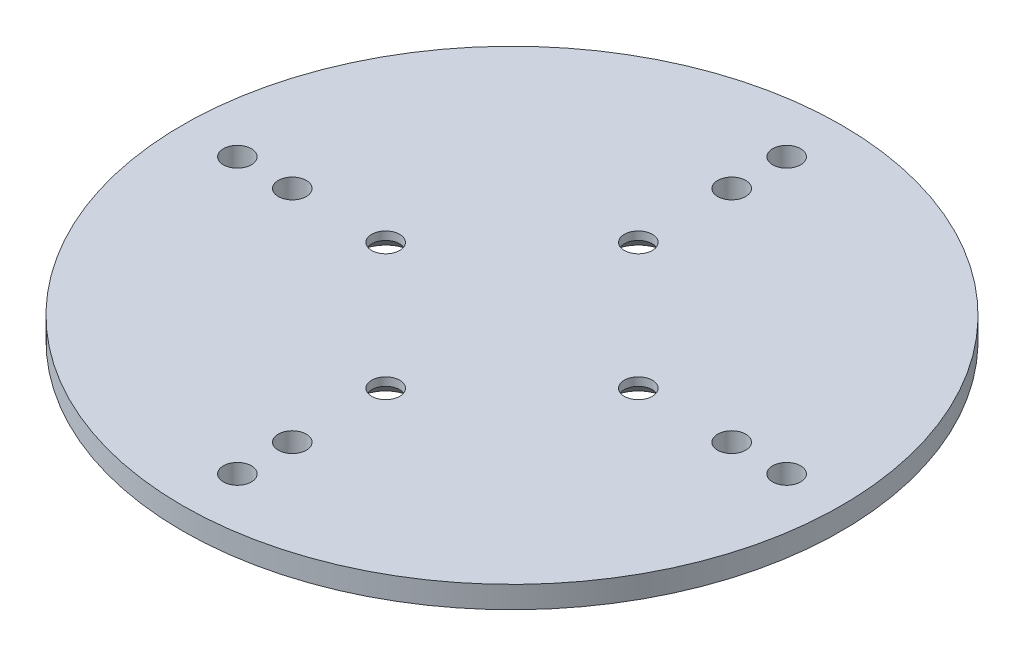
ISO-10303-21;
HEADER;
FILE_DESCRIPTION(('STEP AP214'),'2;1');
FILE_NAME('part.step','',(''),(''),'','','');
FILE_SCHEMA(('AUTOMOTIVE_DESIGN { 1 0 10303 214 1 1 1 1 }'));
ENDSEC;
DATA;
#1=APPLICATION_CONTEXT('core data for automotive mechanical design processes');
#2=APPLICATION_PROTOCOL_DEFINITION('international standard','automotive_design',2000,#1);
#3=PRODUCT_CONTEXT('',#1,'mechanical');
#4=PRODUCT('Part','Part','',(#3));
#5=PRODUCT_RELATED_PRODUCT_CATEGORY('part','',(#4));
#6=PRODUCT_DEFINITION_FORMATION('','',#4);
#7=PRODUCT_DEFINITION_CONTEXT('part definition',#1,'design');
#8=PRODUCT_DEFINITION('design','',#6,#7);
#9=PRODUCT_DEFINITION_SHAPE('','',#8);
#10=(LENGTH_UNIT() NAMED_UNIT(*) SI_UNIT(.MILLI.,.METRE.));
#11=(NAMED_UNIT(*) PLANE_ANGLE_UNIT() SI_UNIT($,.RADIAN.));
#12=(NAMED_UNIT(*) SI_UNIT($,.STERADIAN.) SOLID_ANGLE_UNIT());
#13=UNCERTAINTY_MEASURE_WITH_UNIT(LENGTH_MEASURE(1.E-05),#10,'distance_accuracy_value','');
#14=(GEOMETRIC_REPRESENTATION_CONTEXT(3) GLOBAL_UNCERTAINTY_ASSIGNED_CONTEXT((#13)) GLOBAL_UNIT_ASSIGNED_CONTEXT((#10,
#11,#12)) REPRESENTATION_CONTEXT('',''));
#15=CARTESIAN_POINT('',(0.,0.,0.));
#16=DIRECTION('',(0.,0.,1.));
#17=DIRECTION('',(1.,0.,0.));
#18=AXIS2_PLACEMENT_3D('',#15,#16,#17);
#19=CARTESIAN_POINT('',(0.,4.,0.));
#20=DIRECTION('',(0.,1.,0.));
#21=DIRECTION('',(0.,0.,1.));
#22=AXIS2_PLACEMENT_3D('',#19,#20,#21);
#23=PLANE('',#22);
#24=CARTESIAN_POINT('',(1.29894857088447E-12,4.,23.));
#25=DIRECTION('',(0.,1.,0.));
#26=DIRECTION('',(0.,0.,1.));
#27=AXIS2_PLACEMENT_3D('',#24,#25,#26);
#28=CIRCLE('',#27,2.5500000000014);
#29=CARTESIAN_POINT('',(1.29894857088447E-12,4.,25.5500000000014));
#30=VERTEX_POINT('',#29);
#31=EDGE_CURVE('E160',#30,#30,#28,.T.);
#32=ORIENTED_EDGE('',*,*,#31,.F.);
#33=EDGE_LOOP('',(#32));
#34=FACE_BOUND('',#33,.T.);
#35=CARTESIAN_POINT('',(-39.9999999999992,4.,8.5265128291212E-13));
#36=DIRECTION('',(0.,1.,0.));
#37=DIRECTION('',(0.,0.,1.));
#38=AXIS2_PLACEMENT_3D('',#35,#36,#37);
#39=CIRCLE('',#38,2.55);
#40=CARTESIAN_POINT('',(-39.9999999999992,4.,2.55000000000085));
#41=VERTEX_POINT('',#40);
#42=EDGE_CURVE('E145',#41,#41,#39,.T.);
#43=ORIENTED_EDGE('',*,*,#42,.F.);
#44=EDGE_LOOP('',(#43));
#45=FACE_BOUND('',#44,.T.);
#46=CARTESIAN_POINT('',(40.0000000000008,4.,-8.47752695715531E-13));
#47=DIRECTION('',(0.,1.,0.));
#48=DIRECTION('',(0.,0.,1.));
#49=AXIS2_PLACEMENT_3D('',#46,#47,#48);
#50=CIRCLE('',#49,2.55);
#51=CARTESIAN_POINT('',(40.0000000000008,4.,2.54999999999915));
#52=VERTEX_POINT('',#51);
#53=EDGE_CURVE('E132',#52,#52,#50,.T.);
#54=ORIENTED_EDGE('',*,*,#53,.F.);
#55=EDGE_LOOP('',(#54));
#56=FACE_BOUND('',#55,.T.);
#57=CARTESIAN_POINT('',(-49.9999999999989,4.,1.13625605381659E-12));
#58=DIRECTION('',(0.,1.,0.));
#59=DIRECTION('',(0.,0.,1.));
#60=AXIS2_PLACEMENT_3D('',#57,#58,#59);
#61=CIRCLE('',#60,2.55);
#62=CARTESIAN_POINT('',(-49.9999999999989,4.,2.55000000000113));
#63=VERTEX_POINT('',#62);
#64=EDGE_CURVE('E117',#63,#63,#61,.T.);
#65=ORIENTED_EDGE('',*,*,#64,.F.);
#66=EDGE_LOOP('',(#65));
#67=FACE_BOUND('',#66,.T.);
#68=CARTESIAN_POINT('',(50.0000000000011,4.,-1.13013281982085E-12));
#69=DIRECTION('',(0.,1.,0.));
#70=DIRECTION('',(0.,0.,1.));
#71=AXIS2_PLACEMENT_3D('',#68,#69,#70);
#72=CIRCLE('',#71,2.55);
#73=CARTESIAN_POINT('',(50.0000000000011,4.,2.54999999999887));
#74=VERTEX_POINT('',#73);
#75=EDGE_CURVE('E101',#74,#74,#72,.T.);
#76=ORIENTED_EDGE('',*,*,#75,.F.);
#77=EDGE_LOOP('',(#76));
#78=FACE_BOUND('',#77,.T.);
#79=CARTESIAN_POINT('',(0.,4.,-50.));
#80=DIRECTION('',(0.,1.,0.));
#81=DIRECTION('',(0.,0.,1.));
#82=AXIS2_PLACEMENT_3D('',#79,#80,#81);
#83=CIRCLE('',#82,2.55);
#84=CARTESIAN_POINT('',(0.,4.,-47.45));
#85=VERTEX_POINT('',#84);
#86=EDGE_CURVE('E85',#85,#85,#83,.T.);
#87=ORIENTED_EDGE('',*,*,#86,.F.);
#88=EDGE_LOOP('',(#87));
#89=FACE_BOUND('',#88,.T.);
#90=CARTESIAN_POINT('',(0.,4.,0.));
#91=DIRECTION('',(0.,1.,0.));
#92=DIRECTION('',(0.,0.,1.));
#93=AXIS2_PLACEMENT_3D('',#90,#91,#92);
#94=CIRCLE('',#93,60.);
#95=CARTESIAN_POINT('',(0.,4.,60.));
#96=VERTEX_POINT('',#95);
#97=EDGE_CURVE('E80',#96,#96,#94,.T.);
#98=ORIENTED_EDGE('',*,*,#97,.T.);
#99=EDGE_LOOP('',(#98));
#100=FACE_BOUND('',#99,.T.);
#101=CARTESIAN_POINT('',(0.,4.,-40.));
#102=DIRECTION('',(0.,1.,0.));
#103=DIRECTION('',(0.,0.,1.));
#104=AXIS2_PLACEMENT_3D('',#101,#102,#103);
#105=CIRCLE('',#104,2.55);
#106=CARTESIAN_POINT('',(0.,4.,-37.45));
#107=VERTEX_POINT('',#106);
#108=EDGE_CURVE('E93',#107,#107,#105,.T.);
#109=ORIENTED_EDGE('',*,*,#108,.F.);
#110=EDGE_LOOP('',(#109));
#111=FACE_BOUND('',#110,.T.);
#112=CARTESIAN_POINT('',(2.2602656396417E-12,4.,50.));
#113=DIRECTION('',(0.,1.,0.));
#114=DIRECTION('',(0.,0.,1.));
#115=AXIS2_PLACEMENT_3D('',#112,#113,#114);
#116=CIRCLE('',#115,2.55);
#117=CARTESIAN_POINT('',(2.2602656396417E-12,4.,52.55));
#118=VERTEX_POINT('',#117);
#119=EDGE_CURVE('E109',#118,#118,#116,.T.);
#120=ORIENTED_EDGE('',*,*,#119,.F.);
#121=EDGE_LOOP('',(#120));
#122=FACE_BOUND('',#121,.T.);
#123=CARTESIAN_POINT('',(0.,4.,-23.));
#124=DIRECTION('',(0.,1.,0.));
#125=DIRECTION('',(0.,0.,1.));
#126=AXIS2_PLACEMENT_3D('',#123,#124,#125);
#127=CIRCLE('',#126,2.55);
#128=CARTESIAN_POINT('',(0.,4.,-20.45));
#129=VERTEX_POINT('',#128);
#130=EDGE_CURVE('E125',#129,#129,#127,.T.);
#131=ORIENTED_EDGE('',*,*,#130,.F.);
#132=EDGE_LOOP('',(#131));
#133=FACE_BOUND('',#132,.T.);
#134=CARTESIAN_POINT('',(1.69550539143106E-12,4.,40.));
#135=DIRECTION('',(0.,1.,0.));
#136=DIRECTION('',(0.,0.,1.));
#137=AXIS2_PLACEMENT_3D('',#134,#135,#136);
#138=CIRCLE('',#137,2.55);
#139=CARTESIAN_POINT('',(1.69550539143106E-12,4.,42.55));
#140=VERTEX_POINT('',#139);
#141=EDGE_CURVE('E137',#140,#140,#138,.T.);
#142=ORIENTED_EDGE('',*,*,#141,.F.);
#143=EDGE_LOOP('',(#142));
#144=FACE_BOUND('',#143,.T.);
#145=CARTESIAN_POINT('',(23.,4.,0.));
#146=DIRECTION('',(0.,1.,0.));
#147=DIRECTION('',(0.,0.,1.));
#148=AXIS2_PLACEMENT_3D('',#145,#146,#147);
#149=CIRCLE('',#148,2.55);
#150=CARTESIAN_POINT('',(23.,4.,2.55000000000008));
#151=VERTEX_POINT('',#150);
#152=EDGE_CURVE('E153',#151,#151,#149,.T.);
#153=ORIENTED_EDGE('',*,*,#152,.F.);
#154=EDGE_LOOP('',(#153));
#155=FACE_BOUND('',#154,.T.);
#156=CARTESIAN_POINT('',(-23.,4.,-2.40912212380176E-13));
#157=DIRECTION('',(0.,1.,0.));
#158=DIRECTION('',(0.,0.,1.));
#159=AXIS2_PLACEMENT_3D('',#156,#157,#158);
#160=CIRCLE('',#159,2.55);
#161=CARTESIAN_POINT('',(-23.,4.,2.54999999999976));
#162=VERTEX_POINT('',#161);
#163=EDGE_CURVE('E164',#162,#162,#160,.T.);
#164=ORIENTED_EDGE('',*,*,#163,.F.);
#165=EDGE_LOOP('',(#164));
#166=FACE_BOUND('',#165,.T.);
#167=ADVANCED_FACE('F39',(#34,#45,#56,#67,#78,#89,#100,#111,#122,#133,#144,#155,#166),#23,.T.);
#168=CARTESIAN_POINT('',(0.,0.,0.));
#169=DIRECTION('',(0.,1.,0.));
#170=DIRECTION('',(0.,0.,1.));
#171=AXIS2_PLACEMENT_3D('',#168,#169,#170);
#172=PLANE('',#171);
#173=CARTESIAN_POINT('',(0.,0.,-23.));
#174=DIRECTION('',(0.,1.,0.));
#175=DIRECTION('',(0.,0.,1.));
#176=AXIS2_PLACEMENT_3D('',#173,#174,#175);
#177=CIRCLE('',#176,5.05000000000004);
#178=CARTESIAN_POINT('',(0.,0.,-17.95));
#179=VERTEX_POINT('',#178);
#180=EDGE_CURVE('E64',#179,#179,#177,.T.);
#181=ORIENTED_EDGE('',*,*,#180,.T.);
#182=EDGE_LOOP('',(#181));
#183=FACE_BOUND('',#182,.T.);
#184=CARTESIAN_POINT('',(23.,0.,0.));
#185=DIRECTION('',(0.,1.,0.));
#186=DIRECTION('',(0.,0.,1.));
#187=AXIS2_PLACEMENT_3D('',#184,#185,#186);
#188=CIRCLE('',#187,5.04999999999998);
#189=CARTESIAN_POINT('',(23.,0.,5.05000000000007));
#190=VERTEX_POINT('',#189);
#191=EDGE_CURVE('E68',#190,#190,#188,.T.);
#192=ORIENTED_EDGE('',*,*,#191,.T.);
#193=EDGE_LOOP('',(#192));
#194=FACE_BOUND('',#193,.T.);
#195=CARTESIAN_POINT('',(1.29894857088447E-12,0.,23.));
#196=DIRECTION('',(0.,1.,0.));
#197=DIRECTION('',(0.,0.,1.));
#198=AXIS2_PLACEMENT_3D('',#195,#196,#197);
#199=CIRCLE('',#198,5.05000000000139);
#200=CARTESIAN_POINT('',(1.29894857088447E-12,0.,28.0500000000014));
#201=VERTEX_POINT('',#200);
#202=EDGE_CURVE('E72',#201,#201,#199,.T.);
#203=ORIENTED_EDGE('',*,*,#202,.T.);
#204=EDGE_LOOP('',(#203));
#205=FACE_BOUND('',#204,.T.);
#206=CARTESIAN_POINT('',(-23.,0.,-2.40912212380176E-13));
#207=DIRECTION('',(0.,1.,0.));
#208=DIRECTION('',(0.,0.,1.));
#209=AXIS2_PLACEMENT_3D('',#206,#207,#208);
#210=CIRCLE('',#209,5.04999999999998);
#211=CARTESIAN_POINT('',(-23.,0.,5.04999999999974));
#212=VERTEX_POINT('',#211);
#213=EDGE_CURVE('E76',#212,#212,#210,.T.);
#214=ORIENTED_EDGE('',*,*,#213,.T.);
#215=EDGE_LOOP('',(#214));
#216=FACE_BOUND('',#215,.T.);
#217=CARTESIAN_POINT('',(0.,0.,0.));
#218=DIRECTION('',(0.,1.,0.));
#219=DIRECTION('',(0.,0.,1.));
#220=AXIS2_PLACEMENT_3D('',#217,#218,#219);
#221=CIRCLE('',#220,60.);
#222=CARTESIAN_POINT('',(0.,0.,60.));
#223=VERTEX_POINT('',#222);
#224=EDGE_CURVE('E81',#223,#223,#221,.T.);
#225=ORIENTED_EDGE('',*,*,#224,.F.);
#226=EDGE_LOOP('',(#225));
#227=FACE_BOUND('',#226,.T.);
#228=CARTESIAN_POINT('',(0.,0.,-50.));
#229=DIRECTION('',(0.,1.,0.));
#230=DIRECTION('',(0.,0.,1.));
#231=AXIS2_PLACEMENT_3D('',#228,#229,#230);
#232=CIRCLE('',#231,2.55);
#233=CARTESIAN_POINT('',(0.,0.,-47.45));
#234=VERTEX_POINT('',#233);
#235=EDGE_CURVE('E89',#234,#234,#232,.T.);
#236=ORIENTED_EDGE('',*,*,#235,.T.);
#237=EDGE_LOOP('',(#236));
#238=FACE_BOUND('',#237,.T.);
#239=CARTESIAN_POINT('',(0.,0.,-40.));
#240=DIRECTION('',(0.,1.,0.));
#241=DIRECTION('',(0.,0.,1.));
#242=AXIS2_PLACEMENT_3D('',#239,#240,#241);
#243=CIRCLE('',#242,2.55);
#244=CARTESIAN_POINT('',(0.,0.,-37.45));
#245=VERTEX_POINT('',#244);
#246=EDGE_CURVE('E97',#245,#245,#243,.T.);
#247=ORIENTED_EDGE('',*,*,#246,.T.);
#248=EDGE_LOOP('',(#247));
#249=FACE_BOUND('',#248,.T.);
#250=CARTESIAN_POINT('',(50.0000000000011,0.,-1.13013281982085E-12));
#251=DIRECTION('',(0.,1.,0.));
#252=DIRECTION('',(0.,0.,1.));
#253=AXIS2_PLACEMENT_3D('',#250,#251,#252);
#254=CIRCLE('',#253,2.55);
#255=CARTESIAN_POINT('',(50.0000000000011,0.,2.54999999999887));
#256=VERTEX_POINT('',#255);
#257=EDGE_CURVE('E105',#256,#256,#254,.T.);
#258=ORIENTED_EDGE('',*,*,#257,.T.);
#259=EDGE_LOOP('',(#258));
#260=FACE_BOUND('',#259,.T.);
#261=CARTESIAN_POINT('',(2.2602656396417E-12,0.,50.));
#262=DIRECTION('',(0.,1.,0.));
#263=DIRECTION('',(0.,0.,1.));
#264=AXIS2_PLACEMENT_3D('',#261,#262,#263);
#265=CIRCLE('',#264,2.55);
#266=CARTESIAN_POINT('',(2.2602656396417E-12,0.,52.55));
#267=VERTEX_POINT('',#266);
#268=EDGE_CURVE('E113',#267,#267,#265,.T.);
#269=ORIENTED_EDGE('',*,*,#268,.T.);
#270=EDGE_LOOP('',(#269));
#271=FACE_BOUND('',#270,.T.);
#272=CARTESIAN_POINT('',(-49.9999999999989,0.,1.13625605381659E-12));
#273=DIRECTION('',(0.,1.,0.));
#274=DIRECTION('',(0.,0.,1.));
#275=AXIS2_PLACEMENT_3D('',#272,#273,#274);
#276=CIRCLE('',#275,2.55);
#277=CARTESIAN_POINT('',(-49.9999999999989,0.,2.55000000000113));
#278=VERTEX_POINT('',#277);
#279=EDGE_CURVE('E121',#278,#278,#276,.T.);
#280=ORIENTED_EDGE('',*,*,#279,.T.);
#281=EDGE_LOOP('',(#280));
#282=FACE_BOUND('',#281,.T.);
#283=CARTESIAN_POINT('',(40.0000000000008,0.,-8.47752695715531E-13));
#284=DIRECTION('',(0.,1.,0.));
#285=DIRECTION('',(0.,0.,1.));
#286=AXIS2_PLACEMENT_3D('',#283,#284,#285);
#287=CIRCLE('',#286,2.55);
#288=CARTESIAN_POINT('',(40.0000000000008,0.,2.54999999999915));
#289=VERTEX_POINT('',#288);
#290=EDGE_CURVE('E133',#289,#289,#287,.T.);
#291=ORIENTED_EDGE('',*,*,#290,.T.);
#292=EDGE_LOOP('',(#291));
#293=FACE_BOUND('',#292,.T.);
#294=CARTESIAN_POINT('',(1.69550539143106E-12,0.,40.));
#295=DIRECTION('',(0.,1.,0.));
#296=DIRECTION('',(0.,0.,1.));
#297=AXIS2_PLACEMENT_3D('',#294,#295,#296);
#298=CIRCLE('',#297,2.55);
#299=CARTESIAN_POINT('',(1.69550539143106E-12,0.,42.55));
#300=VERTEX_POINT('',#299);
#301=EDGE_CURVE('E141',#300,#300,#298,.T.);
#302=ORIENTED_EDGE('',*,*,#301,.T.);
#303=EDGE_LOOP('',(#302));
#304=FACE_BOUND('',#303,.T.);
#305=CARTESIAN_POINT('',(-39.9999999999992,0.,8.5265128291212E-13));
#306=DIRECTION('',(0.,1.,0.));
#307=DIRECTION('',(0.,0.,1.));
#308=AXIS2_PLACEMENT_3D('',#305,#306,#307);
#309=CIRCLE('',#308,2.55);
#310=CARTESIAN_POINT('',(-39.9999999999992,0.,2.55000000000085));
#311=VERTEX_POINT('',#310);
#312=EDGE_CURVE('E149',#311,#311,#309,.T.);
#313=ORIENTED_EDGE('',*,*,#312,.T.);
#314=EDGE_LOOP('',(#313));
#315=FACE_BOUND('',#314,.T.);
#316=ADVANCED_FACE('F172',(#183,#194,#205,#216,#227,#238,#249,#260,#271,#282,#293,#304,#315),
#172,.F.);
#317=CARTESIAN_POINT('',(0.,4.,0.));
#318=DIRECTION('',(0.,-1.,0.));
#319=DIRECTION('',(0.,0.,-1.));
#320=AXIS2_PLACEMENT_3D('',#317,#318,#319);
#321=CYLINDRICAL_SURFACE('',#320,60.);
#322=ORIENTED_EDGE('',*,*,#97,.F.);
#323=EDGE_LOOP('',(#322));
#324=FACE_BOUND('',#323,.T.);
#325=ORIENTED_EDGE('',*,*,#224,.T.);
#326=EDGE_LOOP('',(#325));
#327=FACE_BOUND('',#326,.T.);
#328=ADVANCED_FACE('F178',(#324,#327),#321,.T.);
#329=CARTESIAN_POINT('',(0.,4.,-50.));
#330=DIRECTION('',(0.,-1.,0.));
#331=DIRECTION('',(0.,0.,-1.));
#332=AXIS2_PLACEMENT_3D('',#329,#330,#331);
#333=CYLINDRICAL_SURFACE('',#332,2.55);
#334=ORIENTED_EDGE('',*,*,#86,.T.);
#335=EDGE_LOOP('',(#334));
#336=FACE_BOUND('',#335,.T.);
#337=ORIENTED_EDGE('',*,*,#235,.F.);
#338=EDGE_LOOP('',(#337));
#339=FACE_BOUND('',#338,.T.);
#340=ADVANCED_FACE('F184',(#336,#339),#333,.F.);
#341=CARTESIAN_POINT('',(0.,4.,-40.));
#342=DIRECTION('',(0.,-1.,0.));
#343=DIRECTION('',(0.,0.,-1.));
#344=AXIS2_PLACEMENT_3D('',#341,#342,#343);
#345=CYLINDRICAL_SURFACE('',#344,2.55);
#346=ORIENTED_EDGE('',*,*,#108,.T.);
#347=EDGE_LOOP('',(#346));
#348=FACE_BOUND('',#347,.T.);
#349=ORIENTED_EDGE('',*,*,#246,.F.);
#350=EDGE_LOOP('',(#349));
#351=FACE_BOUND('',#350,.T.);
#352=ADVANCED_FACE('F272',(#348,#351),#345,.F.);
#353=CARTESIAN_POINT('',(50.0000000000011,4.,-1.13013281982085E-12));
#354=DIRECTION('',(0.,-1.,0.));
#355=DIRECTION('',(0.,0.,-1.));
#356=AXIS2_PLACEMENT_3D('',#353,#354,#355);
#357=CYLINDRICAL_SURFACE('',#356,2.55);
#358=ORIENTED_EDGE('',*,*,#75,.T.);
#359=EDGE_LOOP('',(#358));
#360=FACE_BOUND('',#359,.T.);
#361=ORIENTED_EDGE('',*,*,#257,.F.);
#362=EDGE_LOOP('',(#361));
#363=FACE_BOUND('',#362,.T.);
#364=ADVANCED_FACE('F269',(#360,#363),#357,.F.);
#365=CARTESIAN_POINT('',(2.2602656396417E-12,4.,50.));
#366=DIRECTION('',(0.,-1.,0.));
#367=DIRECTION('',(0.,0.,-1.));
#368=AXIS2_PLACEMENT_3D('',#365,#366,#367);
#369=CYLINDRICAL_SURFACE('',#368,2.55);
#370=ORIENTED_EDGE('',*,*,#119,.T.);
#371=EDGE_LOOP('',(#370));
#372=FACE_BOUND('',#371,.T.);
#373=ORIENTED_EDGE('',*,*,#268,.F.);
#374=EDGE_LOOP('',(#373));
#375=FACE_BOUND('',#374,.T.);
#376=ADVANCED_FACE('F265',(#372,#375),#369,.F.);
#377=CARTESIAN_POINT('',(-49.9999999999989,4.,1.13625605381659E-12));
#378=DIRECTION('',(0.,-1.,0.));
#379=DIRECTION('',(0.,0.,-1.));
#380=AXIS2_PLACEMENT_3D('',#377,#378,#379);
#381=CYLINDRICAL_SURFACE('',#380,2.55);
#382=ORIENTED_EDGE('',*,*,#64,.T.);
#383=EDGE_LOOP('',(#382));
#384=FACE_BOUND('',#383,.T.);
#385=ORIENTED_EDGE('',*,*,#279,.F.);
#386=EDGE_LOOP('',(#385));
#387=FACE_BOUND('',#386,.T.);
#388=ADVANCED_FACE('F261',(#384,#387),#381,.F.);
#389=CARTESIAN_POINT('',(0.,4.,-23.));
#390=DIRECTION('',(0.,-1.,0.));
#391=DIRECTION('',(0.,0.,-1.));
#392=AXIS2_PLACEMENT_3D('',#389,#390,#391);
#393=CYLINDRICAL_SURFACE('',#392,2.55);
#394=CARTESIAN_POINT('',(0.,2.50000000000006,-23.));
#395=DIRECTION('',(0.,1.,0.));
#396=DIRECTION('',(0.,0.,1.));
#397=AXIS2_PLACEMENT_3D('',#394,#395,#396);
#398=CIRCLE('',#397,2.55);
#399=CARTESIAN_POINT('',(0.,2.50000000000006,-20.45));
#400=VERTEX_POINT('',#399);
#401=EDGE_CURVE('E58',#400,#400,#398,.F.);
#402=ORIENTED_EDGE('',*,*,#401,.T.);
#403=EDGE_LOOP('',(#402));
#404=FACE_BOUND('',#403,.T.);
#405=ORIENTED_EDGE('',*,*,#130,.T.);
#406=EDGE_LOOP('',(#405));
#407=FACE_BOUND('',#406,.T.);
#408=ADVANCED_FACE('F257',(#404,#407),#393,.F.);
#409=CARTESIAN_POINT('',(40.0000000000008,4.,-8.47752695715531E-13));
#410=DIRECTION('',(0.,-1.,0.));
#411=DIRECTION('',(0.,0.,-1.));
#412=AXIS2_PLACEMENT_3D('',#409,#410,#411);
#413=CYLINDRICAL_SURFACE('',#412,2.55);
#414=ORIENTED_EDGE('',*,*,#53,.T.);
#415=EDGE_LOOP('',(#414));
#416=FACE_BOUND('',#415,.T.);
#417=ORIENTED_EDGE('',*,*,#290,.F.);
#418=EDGE_LOOP('',(#417));
#419=FACE_BOUND('',#418,.T.);
#420=ADVANCED_FACE('F250',(#416,#419),#413,.F.);
#421=CARTESIAN_POINT('',(1.69550539143106E-12,4.,40.));
#422=DIRECTION('',(0.,-1.,0.));
#423=DIRECTION('',(0.,0.,-1.));
#424=AXIS2_PLACEMENT_3D('',#421,#422,#423);
#425=CYLINDRICAL_SURFACE('',#424,2.55);
#426=ORIENTED_EDGE('',*,*,#141,.T.);
#427=EDGE_LOOP('',(#426));
#428=FACE_BOUND('',#427,.T.);
#429=ORIENTED_EDGE('',*,*,#301,.F.);
#430=EDGE_LOOP('',(#429));
#431=FACE_BOUND('',#430,.T.);
#432=ADVANCED_FACE('F240',(#428,#431),#425,.F.);
#433=CARTESIAN_POINT('',(-39.9999999999992,4.,8.5265128291212E-13));
#434=DIRECTION('',(0.,-1.,0.));
#435=DIRECTION('',(0.,0.,-1.));
#436=AXIS2_PLACEMENT_3D('',#433,#434,#435);
#437=CYLINDRICAL_SURFACE('',#436,2.55);
#438=ORIENTED_EDGE('',*,*,#42,.T.);
#439=EDGE_LOOP('',(#438));
#440=FACE_BOUND('',#439,.T.);
#441=ORIENTED_EDGE('',*,*,#312,.F.);
#442=EDGE_LOOP('',(#441));
#443=FACE_BOUND('',#442,.T.);
#444=ADVANCED_FACE('F237',(#440,#443),#437,.F.);
#445=CARTESIAN_POINT('',(23.,4.,0.));
#446=DIRECTION('',(0.,-1.,0.));
#447=DIRECTION('',(0.,0.,-1.));
#448=AXIS2_PLACEMENT_3D('',#445,#446,#447);
#449=CYLINDRICAL_SURFACE('',#448,2.55);
#450=CARTESIAN_POINT('',(23.,2.5,0.));
#451=DIRECTION('',(0.,1.,0.));
#452=DIRECTION('',(0.,0.,1.));
#453=AXIS2_PLACEMENT_3D('',#450,#451,#452);
#454=CIRCLE('',#453,2.55);
#455=CARTESIAN_POINT('',(23.,2.5,2.55000000000008));
#456=VERTEX_POINT('',#455);
#457=EDGE_CURVE('E53',#456,#456,#454,.F.);
#458=ORIENTED_EDGE('',*,*,#457,.T.);
#459=EDGE_LOOP('',(#458));
#460=FACE_BOUND('',#459,.T.);
#461=ORIENTED_EDGE('',*,*,#152,.T.);
#462=EDGE_LOOP('',(#461));
#463=FACE_BOUND('',#462,.T.);
#464=ADVANCED_FACE('F239',(#460,#463),#449,.F.);
#465=CARTESIAN_POINT('',(1.29894857088447E-12,4.,23.));
#466=DIRECTION('',(0.,-1.,0.));
#467=DIRECTION('',(0.,0.,-1.));
#468=AXIS2_PLACEMENT_3D('',#465,#466,#467);
#469=CYLINDRICAL_SURFACE('',#468,2.5500000000014);
#470=CARTESIAN_POINT('',(1.29894857088447E-12,2.49999999999999,23.));
#471=DIRECTION('',(0.,1.,0.));
#472=DIRECTION('',(0.,0.,1.));
#473=AXIS2_PLACEMENT_3D('',#470,#471,#472);
#474=CIRCLE('',#473,2.5500000000014);
#475=CARTESIAN_POINT('',(1.29894857088447E-12,2.49999999999999,25.5500000000014));
#476=VERTEX_POINT('',#475);
#477=EDGE_CURVE('E48',#476,#476,#474,.F.);
#478=ORIENTED_EDGE('',*,*,#477,.T.);
#479=EDGE_LOOP('',(#478));
#480=FACE_BOUND('',#479,.T.);
#481=ORIENTED_EDGE('',*,*,#31,.T.);
#482=EDGE_LOOP('',(#481));
#483=FACE_BOUND('',#482,.T.);
#484=ADVANCED_FACE('F247',(#480,#483),#469,.F.);
#485=CARTESIAN_POINT('',(-23.,4.,-2.40912212380176E-13));
#486=DIRECTION('',(0.,-1.,0.));
#487=DIRECTION('',(0.,0.,-1.));
#488=AXIS2_PLACEMENT_3D('',#485,#486,#487);
#489=CYLINDRICAL_SURFACE('',#488,2.55);
#490=CARTESIAN_POINT('',(-23.,2.5,-2.40912212380176E-13));
#491=DIRECTION('',(0.,1.,0.));
#492=DIRECTION('',(0.,0.,1.));
#493=AXIS2_PLACEMENT_3D('',#490,#491,#492);
#494=CIRCLE('',#493,2.55);
#495=CARTESIAN_POINT('',(-23.,2.5,2.54999999999976));
#496=VERTEX_POINT('',#495);
#497=EDGE_CURVE('E10',#496,#496,#494,.F.);
#498=ORIENTED_EDGE('',*,*,#497,.T.);
#499=EDGE_LOOP('',(#498));
#500=FACE_BOUND('',#499,.T.);
#501=ORIENTED_EDGE('',*,*,#163,.T.);
#502=EDGE_LOOP('',(#501));
#503=FACE_BOUND('',#502,.T.);
#504=ADVANCED_FACE('F169',(#500,#503),#489,.F.);
#505=CARTESIAN_POINT('',(0.,0.,-23.));
#506=DIRECTION('',(0.,-1.,0.));
#507=DIRECTION('',(0.,0.,-1.));
#508=AXIS2_PLACEMENT_3D('',#505,#506,#507);
#509=CONICAL_SURFACE('',#508,5.05000000000004,0.785398163397445);
#510=ORIENTED_EDGE('',*,*,#401,.F.);
#511=EDGE_LOOP('',(#510));
#512=FACE_BOUND('',#511,.T.);
#513=ORIENTED_EDGE('',*,*,#180,.F.);
#514=EDGE_LOOP('',(#513));
#515=FACE_BOUND('',#514,.T.);
#516=ADVANCED_FACE('F191',(#512,#515),#509,.F.);
#517=CARTESIAN_POINT('',(23.,0.,0.));
#518=DIRECTION('',(0.,-1.,0.));
#519=DIRECTION('',(0.,0.,-1.));
#520=AXIS2_PLACEMENT_3D('',#517,#518,#519);
#521=CONICAL_SURFACE('',#520,5.04999999999998,0.785398163397445);
#522=ORIENTED_EDGE('',*,*,#457,.F.);
#523=EDGE_LOOP('',(#522));
#524=FACE_BOUND('',#523,.T.);
#525=ORIENTED_EDGE('',*,*,#191,.F.);
#526=EDGE_LOOP('',(#525));
#527=FACE_BOUND('',#526,.T.);
#528=ADVANCED_FACE('F197',(#524,#527),#521,.F.);
#529=CARTESIAN_POINT('',(1.29894857088447E-12,0.,23.));
#530=DIRECTION('',(0.,-1.,0.));
#531=DIRECTION('',(0.,0.,-1.));
#532=AXIS2_PLACEMENT_3D('',#529,#530,#531);
#533=CONICAL_SURFACE('',#532,5.05000000000139,0.785398163397448);
#534=ORIENTED_EDGE('',*,*,#477,.F.);
#535=EDGE_LOOP('',(#534));
#536=FACE_BOUND('',#535,.T.);
#537=ORIENTED_EDGE('',*,*,#202,.F.);
#538=EDGE_LOOP('',(#537));
#539=FACE_BOUND('',#538,.T.);
#540=ADVANCED_FACE('F203',(#536,#539),#533,.F.);
#541=CARTESIAN_POINT('',(-23.,0.,-2.40912212380176E-13));
#542=DIRECTION('',(0.,-1.,0.));
#543=DIRECTION('',(0.,0.,-1.));
#544=AXIS2_PLACEMENT_3D('',#541,#542,#543);
#545=CONICAL_SURFACE('',#544,5.04999999999998,0.785398163397445);
#546=ORIENTED_EDGE('',*,*,#497,.F.);
#547=EDGE_LOOP('',(#546));
#548=FACE_BOUND('',#547,.T.);
#549=ORIENTED_EDGE('',*,*,#213,.F.);
#550=EDGE_LOOP('',(#549));
#551=FACE_BOUND('',#550,.T.);
#552=ADVANCED_FACE('F42',(#548,#551),#545,.F.);
#553=CLOSED_SHELL('',(#167,#316,#328,#340,#352,#364,#376,#388,#408,#420,#432,#444,#464,#484,
#504,#516,#528,#540,#552));
#554=MANIFOLD_SOLID_BREP('B2',#553);
#555=ADVANCED_BREP_SHAPE_REPRESENTATION('',(#18,#554),#14);
#556=SHAPE_DEFINITION_REPRESENTATION(#9,#555);
ENDSEC;
END-ISO-10303-21;
